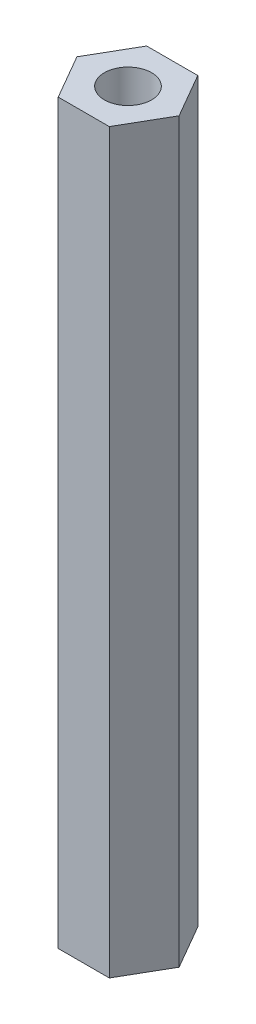
ISO-10303-21;
HEADER;
FILE_DESCRIPTION(('STEP AP214'),'2;1');
FILE_NAME('part.step','',(''),(''),'','','');
FILE_SCHEMA(('AUTOMOTIVE_DESIGN { 1 0 10303 214 1 1 1 1 }'));
ENDSEC;
DATA;
#1=APPLICATION_CONTEXT('core data for automotive mechanical design processes');
#2=APPLICATION_PROTOCOL_DEFINITION('international standard','automotive_design',2000,#1);
#3=PRODUCT_CONTEXT('',#1,'mechanical');
#4=PRODUCT('Part','Part','',(#3));
#5=PRODUCT_RELATED_PRODUCT_CATEGORY('part','',(#4));
#6=PRODUCT_DEFINITION_FORMATION('','',#4);
#7=PRODUCT_DEFINITION_CONTEXT('part definition',#1,'design');
#8=PRODUCT_DEFINITION('design','',#6,#7);
#9=PRODUCT_DEFINITION_SHAPE('','',#8);
#10=(LENGTH_UNIT() NAMED_UNIT(*) SI_UNIT(.MILLI.,.METRE.));
#11=(NAMED_UNIT(*) PLANE_ANGLE_UNIT() SI_UNIT($,.RADIAN.));
#12=(NAMED_UNIT(*) SI_UNIT($,.STERADIAN.) SOLID_ANGLE_UNIT());
#13=UNCERTAINTY_MEASURE_WITH_UNIT(LENGTH_MEASURE(1.E-05),#10,'distance_accuracy_value','');
#14=(GEOMETRIC_REPRESENTATION_CONTEXT(3) GLOBAL_UNCERTAINTY_ASSIGNED_CONTEXT((#13)) GLOBAL_UNIT_ASSIGNED_CONTEXT((#10,
#11,#12)) REPRESENTATION_CONTEXT('',''));
#15=CARTESIAN_POINT('',(0.,0.,0.));
#16=DIRECTION('',(0.,0.,1.));
#17=DIRECTION('',(1.,0.,0.));
#18=AXIS2_PLACEMENT_3D('',#15,#16,#17);
#19=CARTESIAN_POINT('',(1.73205080756891,50.,2.99999999999997));
#20=DIRECTION('',(-0.866025403784442,0.,-0.499999999999995));
#21=DIRECTION('',(-0.499999999999995,0.,0.866025403784442));
#22=AXIS2_PLACEMENT_3D('',#19,#20,#21);
#23=PLANE('',#22);
#24=DIRECTION('',(0.499999999999995,0.,-0.866025403784441));
#25=VECTOR('',#24,1.);
#26=CARTESIAN_POINT('',(1.73205080756891,0.,2.99999999999997));
#27=LINE('',#26,#25);
#28=CARTESIAN_POINT('',(1.73205080756891,0.,2.99999999999997));
#29=VERTEX_POINT('',#28);
#30=CARTESIAN_POINT('',(3.46410161513774,0.,0.));
#31=VERTEX_POINT('',#30);
#32=EDGE_CURVE('E119',#29,#31,#27,.T.);
#33=ORIENTED_EDGE('',*,*,#32,.T.);
#34=DIRECTION('',(0.,-1.,0.));
#35=VECTOR('',#34,1.);
#36=CARTESIAN_POINT('',(3.46410161513774,50.,0.));
#37=LINE('',#36,#35);
#38=CARTESIAN_POINT('',(3.46410161513774,50.,0.));
#39=VERTEX_POINT('',#38);
#40=EDGE_CURVE('E11',#39,#31,#37,.T.);
#41=ORIENTED_EDGE('',*,*,#40,.F.);
#42=DIRECTION('',(0.499999999999995,0.,-0.866025403784441));
#43=VECTOR('',#42,1.);
#44=CARTESIAN_POINT('',(1.73205080756891,50.,2.99999999999997));
#45=LINE('',#44,#43);
#46=CARTESIAN_POINT('',(1.73205080756891,50.,2.99999999999997));
#47=VERTEX_POINT('',#46);
#48=EDGE_CURVE('E130',#47,#39,#45,.T.);
#49=ORIENTED_EDGE('',*,*,#48,.F.);
#50=DIRECTION('',(0.,-1.,0.));
#51=VECTOR('',#50,1.);
#52=CARTESIAN_POINT('',(1.73205080756891,50.,2.99999999999997));
#53=LINE('',#52,#51);
#54=EDGE_CURVE('E115',#47,#29,#53,.T.);
#55=ORIENTED_EDGE('',*,*,#54,.T.);
#56=EDGE_LOOP('',(#33,#41,#49,#55));
#57=FACE_BOUND('',#56,.T.);
#58=ADVANCED_FACE('F35',(#57),#23,.F.);
#59=CARTESIAN_POINT('',(3.46410161513774,50.,0.));
#60=DIRECTION('',(-0.866025403784438,0.,0.500000000000001));
#61=DIRECTION('',(0.500000000000001,0.,0.866025403784438));
#62=AXIS2_PLACEMENT_3D('',#59,#60,#61);
#63=PLANE('',#62);
#64=DIRECTION('',(-0.500000000000001,0.,-0.866025403784438));
#65=VECTOR('',#64,1.);
#66=CARTESIAN_POINT('',(3.46410161513774,0.,0.));
#67=LINE('',#66,#65);
#68=CARTESIAN_POINT('',(1.73205080756886,0.,-2.99999999999999));
#69=VERTEX_POINT('',#68);
#70=EDGE_CURVE('E122',#31,#69,#67,.T.);
#71=ORIENTED_EDGE('',*,*,#70,.T.);
#72=DIRECTION('',(0.,-1.,0.));
#73=VECTOR('',#72,1.);
#74=CARTESIAN_POINT('',(1.73205080756886,50.,-2.99999999999999));
#75=LINE('',#74,#73);
#76=CARTESIAN_POINT('',(1.73205080756886,50.,-2.99999999999999));
#77=VERTEX_POINT('',#76);
#78=EDGE_CURVE('E43',#77,#69,#75,.T.);
#79=ORIENTED_EDGE('',*,*,#78,.F.);
#80=DIRECTION('',(-0.500000000000001,0.,-0.866025403784438));
#81=VECTOR('',#80,1.);
#82=CARTESIAN_POINT('',(3.46410161513774,50.,0.));
#83=LINE('',#82,#81);
#84=EDGE_CURVE('E88',#39,#77,#83,.T.);
#85=ORIENTED_EDGE('',*,*,#84,.F.);
#86=ORIENTED_EDGE('',*,*,#40,.T.);
#87=EDGE_LOOP('',(#71,#79,#85,#86));
#88=FACE_BOUND('',#87,.T.);
#89=ADVANCED_FACE('F155',(#88),#63,.F.);
#90=CARTESIAN_POINT('',(1.73205080756886,50.,-2.99999999999999));
#91=DIRECTION('',(0.,0.,1.));
#92=DIRECTION('',(1.,0.,0.));
#93=AXIS2_PLACEMENT_3D('',#90,#91,#92);
#94=PLANE('',#93);
#95=DIRECTION('',(-1.,0.,0.));
#96=VECTOR('',#95,1.);
#97=CARTESIAN_POINT('',(1.73205080756886,0.,-2.99999999999999));
#98=LINE('',#97,#96);
#99=CARTESIAN_POINT('',(-1.73205080756888,0.,-2.99999999999998));
#100=VERTEX_POINT('',#99);
#101=EDGE_CURVE('E125',#69,#100,#98,.T.);
#102=ORIENTED_EDGE('',*,*,#101,.T.);
#103=DIRECTION('',(0.,-1.,0.));
#104=VECTOR('',#103,1.);
#105=CARTESIAN_POINT('',(-1.73205080756888,50.,-2.99999999999998));
#106=LINE('',#105,#104);
#107=CARTESIAN_POINT('',(-1.73205080756888,50.,-2.99999999999998));
#108=VERTEX_POINT('',#107);
#109=EDGE_CURVE('E110',#108,#100,#106,.T.);
#110=ORIENTED_EDGE('',*,*,#109,.F.);
#111=DIRECTION('',(-1.,0.,0.));
#112=VECTOR('',#111,1.);
#113=CARTESIAN_POINT('',(1.73205080756886,50.,-2.99999999999999));
#114=LINE('',#113,#112);
#115=EDGE_CURVE('E101',#77,#108,#114,.T.);
#116=ORIENTED_EDGE('',*,*,#115,.F.);
#117=ORIENTED_EDGE('',*,*,#78,.T.);
#118=EDGE_LOOP('',(#102,#110,#116,#117));
#119=FACE_BOUND('',#118,.T.);
#120=ADVANCED_FACE('F136',(#119),#94,.F.);
#121=CARTESIAN_POINT('',(-1.73205080756888,50.,-2.99999999999998));
#122=DIRECTION('',(0.866025403784442,0.,0.499999999999995));
#123=DIRECTION('',(0.499999999999995,0.,-0.866025403784442));
#124=AXIS2_PLACEMENT_3D('',#121,#122,#123);
#125=PLANE('',#124);
#126=DIRECTION('',(-0.499999999999995,0.,0.866025403784441));
#127=VECTOR('',#126,1.);
#128=CARTESIAN_POINT('',(-1.73205080756888,0.,-2.99999999999998));
#129=LINE('',#128,#127);
#130=CARTESIAN_POINT('',(-3.46410161513774,0.,0.));
#131=VERTEX_POINT('',#130);
#132=EDGE_CURVE('E109',#100,#131,#129,.T.);
#133=ORIENTED_EDGE('',*,*,#132,.T.);
#134=DIRECTION('',(0.,-1.,0.));
#135=VECTOR('',#134,1.);
#136=CARTESIAN_POINT('',(-3.46410161513774,50.,0.));
#137=LINE('',#136,#135);
#138=CARTESIAN_POINT('',(-3.46410161513774,50.,0.));
#139=VERTEX_POINT('',#138);
#140=EDGE_CURVE('E106',#139,#131,#137,.T.);
#141=ORIENTED_EDGE('',*,*,#140,.F.);
#142=DIRECTION('',(-0.499999999999995,0.,0.866025403784441));
#143=VECTOR('',#142,1.);
#144=CARTESIAN_POINT('',(-1.73205080756888,50.,-2.99999999999998));
#145=LINE('',#144,#143);
#146=EDGE_CURVE('E95',#108,#139,#145,.T.);
#147=ORIENTED_EDGE('',*,*,#146,.F.);
#148=ORIENTED_EDGE('',*,*,#109,.T.);
#149=EDGE_LOOP('',(#133,#141,#147,#148));
#150=FACE_BOUND('',#149,.T.);
#151=ADVANCED_FACE('F107',(#150),#125,.F.);
#152=CARTESIAN_POINT('',(-3.46410161513774,50.,0.));
#153=DIRECTION('',(0.866025403784435,0.,-0.500000000000007));
#154=DIRECTION('',(-0.500000000000007,0.,-0.866025403784435));
#155=AXIS2_PLACEMENT_3D('',#152,#153,#154);
#156=PLANE('',#155);
#157=DIRECTION('',(0.500000000000007,0.,0.866025403784435));
#158=VECTOR('',#157,1.);
#159=CARTESIAN_POINT('',(-3.46410161513774,0.,0.));
#160=LINE('',#159,#158);
#161=CARTESIAN_POINT('',(-1.73205080756884,0.,3.));
#162=VERTEX_POINT('',#161);
#163=EDGE_CURVE('E74',#131,#162,#160,.T.);
#164=ORIENTED_EDGE('',*,*,#163,.T.);
#165=DIRECTION('',(0.,-1.,0.));
#166=VECTOR('',#165,1.);
#167=CARTESIAN_POINT('',(-1.73205080756884,50.,3.));
#168=LINE('',#167,#166);
#169=CARTESIAN_POINT('',(-1.73205080756884,50.,3.));
#170=VERTEX_POINT('',#169);
#171=EDGE_CURVE('E111',#170,#162,#168,.T.);
#172=ORIENTED_EDGE('',*,*,#171,.F.);
#173=DIRECTION('',(0.500000000000007,0.,0.866025403784435));
#174=VECTOR('',#173,1.);
#175=CARTESIAN_POINT('',(-3.46410161513774,50.,0.));
#176=LINE('',#175,#174);
#177=EDGE_CURVE('E99',#139,#170,#176,.T.);
#178=ORIENTED_EDGE('',*,*,#177,.F.);
#179=ORIENTED_EDGE('',*,*,#140,.T.);
#180=EDGE_LOOP('',(#164,#172,#178,#179));
#181=FACE_BOUND('',#180,.T.);
#182=ADVANCED_FACE('F113',(#181),#156,.F.);
#183=CARTESIAN_POINT('',(-1.73205080756884,50.,3.));
#184=DIRECTION('',(0.,0.,-1.));
#185=DIRECTION('',(-1.,0.,0.));
#186=AXIS2_PLACEMENT_3D('',#183,#184,#185);
#187=PLANE('',#186);
#188=DIRECTION('',(1.,0.,0.));
#189=VECTOR('',#188,1.);
#190=CARTESIAN_POINT('',(-1.73205080756884,0.,3.));
#191=LINE('',#190,#189);
#192=EDGE_CURVE('E80',#162,#29,#191,.T.);
#193=ORIENTED_EDGE('',*,*,#192,.T.);
#194=ORIENTED_EDGE('',*,*,#54,.F.);
#195=DIRECTION('',(1.,0.,0.));
#196=VECTOR('',#195,1.);
#197=CARTESIAN_POINT('',(-1.73205080756884,50.,3.));
#198=LINE('',#197,#196);
#199=EDGE_CURVE('E51',#170,#47,#198,.T.);
#200=ORIENTED_EDGE('',*,*,#199,.F.);
#201=ORIENTED_EDGE('',*,*,#171,.T.);
#202=EDGE_LOOP('',(#193,#194,#200,#201));
#203=FACE_BOUND('',#202,.T.);
#204=ADVANCED_FACE('F143',(#203),#187,.F.);
#205=CARTESIAN_POINT('',(0.,50.,0.));
#206=DIRECTION('',(0.,1.,0.));
#207=DIRECTION('',(0.,0.,1.));
#208=AXIS2_PLACEMENT_3D('',#205,#206,#207);
#209=PLANE('',#208);
#210=CARTESIAN_POINT('',(0.,50.,0.));
#211=DIRECTION('',(0.,1.,0.));
#212=DIRECTION('',(0.,0.,1.));
#213=AXIS2_PLACEMENT_3D('',#210,#211,#212);
#214=CIRCLE('',#213,1.6);
#215=CARTESIAN_POINT('',(0.,50.,1.6));
#216=VERTEX_POINT('',#215);
#217=EDGE_CURVE('E210',#216,#216,#214,.T.);
#218=ORIENTED_EDGE('',*,*,#217,.F.);
#219=EDGE_LOOP('',(#218));
#220=FACE_BOUND('',#219,.T.);
#221=ORIENTED_EDGE('',*,*,#48,.T.);
#222=ORIENTED_EDGE('',*,*,#84,.T.);
#223=ORIENTED_EDGE('',*,*,#115,.T.);
#224=ORIENTED_EDGE('',*,*,#146,.T.);
#225=ORIENTED_EDGE('',*,*,#177,.T.);
#226=ORIENTED_EDGE('',*,*,#199,.T.);
#227=EDGE_LOOP('',(#221,#222,#223,#224,#225,#226));
#228=FACE_BOUND('',#227,.T.);
#229=ADVANCED_FACE('F97',(#220,#228),#209,.T.);
#230=CARTESIAN_POINT('',(0.,0.,0.));
#231=DIRECTION('',(0.,1.,0.));
#232=DIRECTION('',(0.,0.,1.));
#233=AXIS2_PLACEMENT_3D('',#230,#231,#232);
#234=PLANE('',#233);
#235=CARTESIAN_POINT('',(0.,0.,0.));
#236=DIRECTION('',(0.,1.,0.));
#237=DIRECTION('',(0.,0.,1.));
#238=AXIS2_PLACEMENT_3D('',#235,#236,#237);
#239=CIRCLE('',#238,1.6);
#240=CARTESIAN_POINT('',(0.,0.,1.6));
#241=VERTEX_POINT('',#240);
#242=EDGE_CURVE('E123',#241,#241,#239,.T.);
#243=ORIENTED_EDGE('',*,*,#242,.T.);
#244=EDGE_LOOP('',(#243));
#245=FACE_BOUND('',#244,.T.);
#246=ORIENTED_EDGE('',*,*,#32,.F.);
#247=ORIENTED_EDGE('',*,*,#192,.F.);
#248=ORIENTED_EDGE('',*,*,#163,.F.);
#249=ORIENTED_EDGE('',*,*,#132,.F.);
#250=ORIENTED_EDGE('',*,*,#101,.F.);
#251=ORIENTED_EDGE('',*,*,#70,.F.);
#252=EDGE_LOOP('',(#246,#247,#248,#249,#250,#251));
#253=FACE_BOUND('',#252,.T.);
#254=ADVANCED_FACE('F139',(#245,#253),#234,.F.);
#255=CARTESIAN_POINT('',(0.,0.,0.));
#256=DIRECTION('',(0.,1.,0.));
#257=DIRECTION('',(0.,0.,1.));
#258=AXIS2_PLACEMENT_3D('',#255,#256,#257);
#259=CYLINDRICAL_SURFACE('',#258,1.6);
#260=ORIENTED_EDGE('',*,*,#242,.F.);
#261=EDGE_LOOP('',(#260));
#262=FACE_BOUND('',#261,.T.);
#263=ORIENTED_EDGE('',*,*,#217,.T.);
#264=EDGE_LOOP('',(#263));
#265=FACE_BOUND('',#264,.T.);
#266=ADVANCED_FACE('F192',(#262,#265),#259,.F.);
#267=CLOSED_SHELL('',(#58,#89,#120,#151,#182,#204,#229,#254,#266));
#268=MANIFOLD_SOLID_BREP('B2',#267);
#269=ADVANCED_BREP_SHAPE_REPRESENTATION('',(#18,#268),#14);
#270=SHAPE_DEFINITION_REPRESENTATION(#9,#269);
ENDSEC;
END-ISO-10303-21;
